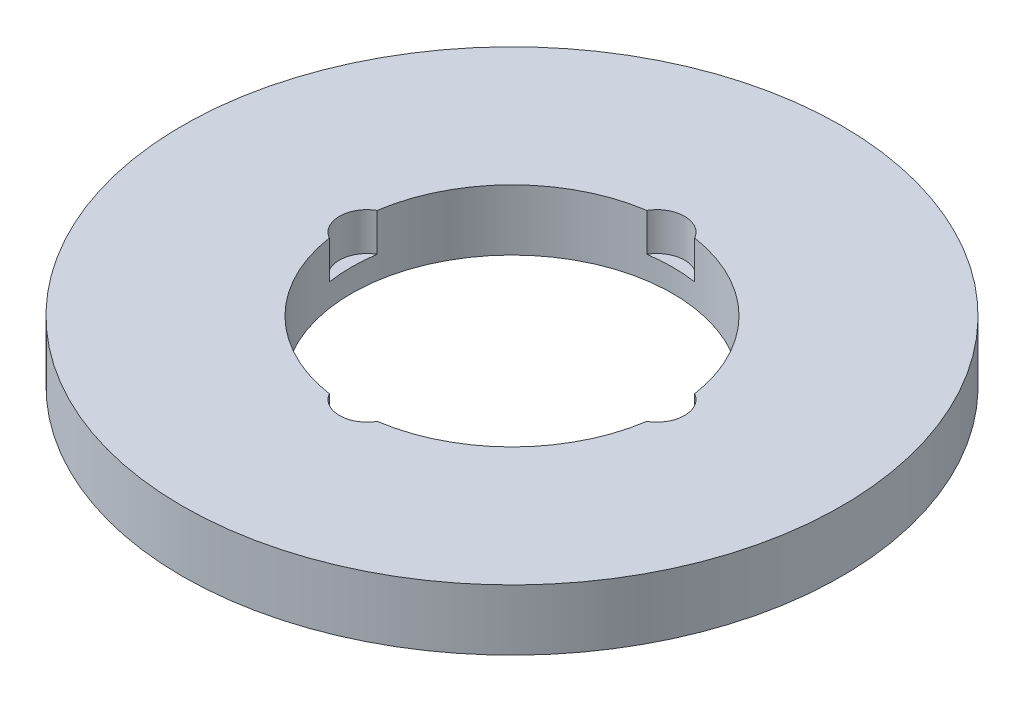
ISO-10303-21;
HEADER;
FILE_DESCRIPTION(('STEP AP214'),'2;1');
FILE_NAME('part.step','',(''),(''),'','','');
FILE_SCHEMA(('AUTOMOTIVE_DESIGN { 1 0 10303 214 1 1 1 1 }'));
ENDSEC;
DATA;
#1=APPLICATION_CONTEXT('core data for automotive mechanical design processes');
#2=APPLICATION_PROTOCOL_DEFINITION('international standard','automotive_design',2000,#1);
#3=PRODUCT_CONTEXT('',#1,'mechanical');
#4=PRODUCT('Part','Part','',(#3));
#5=PRODUCT_RELATED_PRODUCT_CATEGORY('part','',(#4));
#6=PRODUCT_DEFINITION_FORMATION('','',#4);
#7=PRODUCT_DEFINITION_CONTEXT('part definition',#1,'design');
#8=PRODUCT_DEFINITION('design','',#6,#7);
#9=PRODUCT_DEFINITION_SHAPE('','',#8);
#10=(LENGTH_UNIT() NAMED_UNIT(*) SI_UNIT(.MILLI.,.METRE.));
#11=(NAMED_UNIT(*) PLANE_ANGLE_UNIT() SI_UNIT($,.RADIAN.));
#12=(NAMED_UNIT(*) SI_UNIT($,.STERADIAN.) SOLID_ANGLE_UNIT());
#13=UNCERTAINTY_MEASURE_WITH_UNIT(LENGTH_MEASURE(1.E-05),#10,'distance_accuracy_value','');
#14=(GEOMETRIC_REPRESENTATION_CONTEXT(3) GLOBAL_UNCERTAINTY_ASSIGNED_CONTEXT((#13)) GLOBAL_UNIT_ASSIGNED_CONTEXT((#10,
#11,#12)) REPRESENTATION_CONTEXT('',''));
#15=CARTESIAN_POINT('',(0.,0.,0.));
#16=DIRECTION('',(0.,0.,1.));
#17=DIRECTION('',(1.,0.,0.));
#18=AXIS2_PLACEMENT_3D('',#15,#16,#17);
#19=CARTESIAN_POINT('',(0.,18.,0.));
#20=DIRECTION('',(0.,-1.,0.));
#21=DIRECTION('',(0.,0.,-1.));
#22=AXIS2_PLACEMENT_3D('',#19,#20,#21);
#23=CYLINDRICAL_SURFACE('',#22,97.5);
#24=CARTESIAN_POINT('',(0.,18.,0.));
#25=DIRECTION('',(0.,1.,0.));
#26=DIRECTION('',(0.,0.,1.));
#27=AXIS2_PLACEMENT_3D('',#24,#25,#26);
#28=CIRCLE('',#27,97.5);
#29=CARTESIAN_POINT('',(0.,18.,97.5));
#30=VERTEX_POINT('',#29);
#31=EDGE_CURVE('E148',#30,#30,#28,.T.);
#32=ORIENTED_EDGE('',*,*,#31,.F.);
#33=EDGE_LOOP('',(#32));
#34=FACE_BOUND('',#33,.T.);
#35=CARTESIAN_POINT('',(0.,0.,0.));
#36=DIRECTION('',(0.,1.,0.));
#37=DIRECTION('',(0.,0.,1.));
#38=AXIS2_PLACEMENT_3D('',#35,#36,#37);
#39=CIRCLE('',#38,97.5);
#40=CARTESIAN_POINT('',(0.,0.,97.5));
#41=VERTEX_POINT('',#40);
#42=EDGE_CURVE('E139',#41,#41,#39,.T.);
#43=ORIENTED_EDGE('',*,*,#42,.T.);
#44=EDGE_LOOP('',(#43));
#45=FACE_BOUND('',#44,.T.);
#46=ADVANCED_FACE('F39',(#34,#45),#23,.T.);
#47=CARTESIAN_POINT('',(0.,18.,0.));
#48=DIRECTION('',(0.,1.,0.));
#49=DIRECTION('',(0.,0.,1.));
#50=AXIS2_PLACEMENT_3D('',#47,#48,#49);
#51=PLANE('',#50);
#52=CARTESIAN_POINT('',(1.49697635126803E-13,18.,42.8751067523688));
#53=DIRECTION('',(0.,1.,0.));
#54=DIRECTION('',(1.,0.,0.));
#55=AXIS2_PLACEMENT_3D('',#52,#53,#54);
#56=CIRCLE('',#55,8.17998089720507);
#57=CARTESIAN_POINT('',(-7.08174296896249,18.,46.9691272701713));
#58=VERTEX_POINT('',#57);
#59=CARTESIAN_POINT('',(7.08174296896282,18.,46.9691272701713));
#60=VERTEX_POINT('',#59);
#61=EDGE_CURVE('E175',#58,#60,#56,.T.);
#62=ORIENTED_EDGE('',*,*,#61,.F.);
#63=CARTESIAN_POINT('',(0.,18.,0.));
#64=DIRECTION('',(0.,1.,0.));
#65=DIRECTION('',(0.,0.,1.));
#66=AXIS2_PLACEMENT_3D('',#63,#64,#65);
#67=CIRCLE('',#66,47.5);
#68=CARTESIAN_POINT('',(-46.9691272701713,18.,7.08174296896266));
#69=VERTEX_POINT('',#68);
#70=EDGE_CURVE('E134',#69,#58,#67,.T.);
#71=ORIENTED_EDGE('',*,*,#70,.F.);
#72=CARTESIAN_POINT('',(-42.8751067523688,18.,0.));
#73=DIRECTION('',(0.,1.,0.));
#74=DIRECTION('',(0.,0.,1.));
#75=AXIS2_PLACEMENT_3D('',#72,#73,#74);
#76=CIRCLE('',#75,8.17998089720507);
#77=CARTESIAN_POINT('',(-46.9691272701713,18.,-7.08174296896266));
#78=VERTEX_POINT('',#77);
#79=EDGE_CURVE('E143',#78,#69,#76,.T.);
#80=ORIENTED_EDGE('',*,*,#79,.F.);
#81=CARTESIAN_POINT('',(-7.08174296896315,18.,-46.9691272701712));
#82=VERTEX_POINT('',#81);
#83=EDGE_CURVE('E123',#82,#78,#67,.T.);
#84=ORIENTED_EDGE('',*,*,#83,.F.);
#85=CARTESIAN_POINT('',(-4.49092905380409E-13,18.,-42.8751067523688));
#86=DIRECTION('',(0.,1.,0.));
#87=DIRECTION('',(-1.,0.,0.));
#88=AXIS2_PLACEMENT_3D('',#85,#86,#87);
#89=CIRCLE('',#88,8.17998089720507);
#90=CARTESIAN_POINT('',(7.08174296896217,18.,-46.9691272701714));
#91=VERTEX_POINT('',#90);
#92=EDGE_CURVE('E106',#91,#82,#89,.T.);
#93=ORIENTED_EDGE('',*,*,#92,.F.);
#94=CARTESIAN_POINT('',(46.9691272701713,18.,-7.08174296896266));
#95=VERTEX_POINT('',#94);
#96=EDGE_CURVE('E125',#95,#91,#67,.T.);
#97=ORIENTED_EDGE('',*,*,#96,.F.);
#98=CARTESIAN_POINT('',(42.8751067523688,18.,0.));
#99=DIRECTION('',(0.,1.,0.));
#100=DIRECTION('',(0.,0.,-1.));
#101=AXIS2_PLACEMENT_3D('',#98,#99,#100);
#102=CIRCLE('',#101,8.17998089720507);
#103=CARTESIAN_POINT('',(46.9691272701713,18.,7.08174296896266));
#104=VERTEX_POINT('',#103);
#105=EDGE_CURVE('E286',#104,#95,#102,.T.);
#106=ORIENTED_EDGE('',*,*,#105,.F.);
#107=EDGE_CURVE('E135',#60,#104,#67,.T.);
#108=ORIENTED_EDGE('',*,*,#107,.F.);
#109=EDGE_LOOP('',(#62,#71,#80,#84,#93,#97,#106,#108));
#110=FACE_BOUND('',#109,.T.);
#111=ORIENTED_EDGE('',*,*,#31,.T.);
#112=EDGE_LOOP('',(#111));
#113=FACE_BOUND('',#112,.T.);
#114=ADVANCED_FACE('F118',(#110,#113),#51,.T.);
#115=CARTESIAN_POINT('',(0.,0.,0.));
#116=DIRECTION('',(0.,1.,0.));
#117=DIRECTION('',(0.,0.,1.));
#118=AXIS2_PLACEMENT_3D('',#115,#116,#117);
#119=PLANE('',#118);
#120=CARTESIAN_POINT('',(0.,0.,0.));
#121=DIRECTION('',(0.,1.,0.));
#122=DIRECTION('',(0.,0.,1.));
#123=AXIS2_PLACEMENT_3D('',#120,#121,#122);
#124=CIRCLE('',#123,47.5);
#125=CARTESIAN_POINT('',(0.,0.,47.5));
#126=VERTEX_POINT('',#125);
#127=EDGE_CURVE('E136',#126,#126,#124,.T.);
#128=ORIENTED_EDGE('',*,*,#127,.T.);
#129=EDGE_LOOP('',(#128));
#130=FACE_BOUND('',#129,.T.);
#131=ORIENTED_EDGE('',*,*,#42,.F.);
#132=EDGE_LOOP('',(#131));
#133=FACE_BOUND('',#132,.T.);
#134=ADVANCED_FACE('F187',(#130,#133),#119,.F.);
#135=CARTESIAN_POINT('',(0.,18.,0.));
#136=DIRECTION('',(0.,-1.,0.));
#137=DIRECTION('',(0.,0.,-1.));
#138=AXIS2_PLACEMENT_3D('',#135,#136,#137);
#139=CYLINDRICAL_SURFACE('',#138,47.5);
#140=DIRECTION('',(0.,1.,0.));
#141=VECTOR('',#140,1.);
#142=CARTESIAN_POINT('',(-7.0817429689625,12.3762977760969,46.9691272701713));
#143=LINE('',#142,#141);
#144=CARTESIAN_POINT('',(-7.08174296896249,6.75259555219374,46.9691272701713));
#145=VERTEX_POINT('',#144);
#146=EDGE_CURVE('E11',#145,#58,#143,.T.);
#147=ORIENTED_EDGE('',*,*,#146,.F.);
#148=CARTESIAN_POINT('',(0.,6.75259555219374,0.));
#149=DIRECTION('',(0.,1.,0.));
#150=DIRECTION('',(0.,0.,1.));
#151=AXIS2_PLACEMENT_3D('',#148,#149,#150);
#152=CIRCLE('',#151,47.5);
#153=CARTESIAN_POINT('',(7.08174296896282,6.75259555219374,46.9691272701713));
#154=VERTEX_POINT('',#153);
#155=EDGE_CURVE('E170',#145,#154,#152,.T.);
#156=ORIENTED_EDGE('',*,*,#155,.T.);
#157=DIRECTION('',(0.,1.,0.));
#158=VECTOR('',#157,1.);
#159=CARTESIAN_POINT('',(7.08174296896282,12.3762977760969,46.9691272701713));
#160=LINE('',#159,#158);
#161=EDGE_CURVE('E46',#60,#154,#160,.F.);
#162=ORIENTED_EDGE('',*,*,#161,.F.);
#163=ORIENTED_EDGE('',*,*,#107,.T.);
#164=DIRECTION('',(0.,1.,0.));
#165=VECTOR('',#164,1.);
#166=CARTESIAN_POINT('',(46.9691272701713,12.3762977760969,7.08174296896266));
#167=LINE('',#166,#165);
#168=CARTESIAN_POINT('',(46.9691272701713,6.75259555219374,7.08174296896266));
#169=VERTEX_POINT('',#168);
#170=EDGE_CURVE('E164',#169,#104,#167,.T.);
#171=ORIENTED_EDGE('',*,*,#170,.F.);
#172=CARTESIAN_POINT('',(0.,6.75259555219374,0.));
#173=DIRECTION('',(0.,1.,0.));
#174=DIRECTION('',(0.,0.,1.));
#175=AXIS2_PLACEMENT_3D('',#172,#173,#174);
#176=CIRCLE('',#175,47.5);
#177=CARTESIAN_POINT('',(46.9691272701713,6.75259555219374,-7.08174296896266));
#178=VERTEX_POINT('',#177);
#179=EDGE_CURVE('E115',#169,#178,#176,.T.);
#180=ORIENTED_EDGE('',*,*,#179,.T.);
#181=DIRECTION('',(0.,1.,0.));
#182=VECTOR('',#181,1.);
#183=CARTESIAN_POINT('',(46.9691272701713,12.3762977760969,-7.08174296896266));
#184=LINE('',#183,#182);
#185=EDGE_CURVE('E131',#95,#178,#184,.F.);
#186=ORIENTED_EDGE('',*,*,#185,.F.);
#187=ORIENTED_EDGE('',*,*,#96,.T.);
#188=DIRECTION('',(0.,1.,0.));
#189=VECTOR('',#188,1.);
#190=CARTESIAN_POINT('',(7.08174296896216,12.3762977760969,-46.9691272701714));
#191=LINE('',#190,#189);
#192=CARTESIAN_POINT('',(7.08174296896217,6.75259555219374,-46.9691272701714));
#193=VERTEX_POINT('',#192);
#194=EDGE_CURVE('E105',#193,#91,#191,.T.);
#195=ORIENTED_EDGE('',*,*,#194,.F.);
#196=CARTESIAN_POINT('',(0.,6.75259555219374,0.));
#197=DIRECTION('',(0.,1.,0.));
#198=DIRECTION('',(0.,0.,1.));
#199=AXIS2_PLACEMENT_3D('',#196,#197,#198);
#200=CIRCLE('',#199,47.5);
#201=CARTESIAN_POINT('',(-7.08174296896315,6.75259555219374,-46.9691272701712));
#202=VERTEX_POINT('',#201);
#203=EDGE_CURVE('E159',#193,#202,#200,.T.);
#204=ORIENTED_EDGE('',*,*,#203,.T.);
#205=DIRECTION('',(0.,1.,0.));
#206=VECTOR('',#205,1.);
#207=CARTESIAN_POINT('',(-7.08174296896315,12.3762977760969,-46.9691272701712));
#208=LINE('',#207,#206);
#209=EDGE_CURVE('E114',#82,#202,#208,.F.);
#210=ORIENTED_EDGE('',*,*,#209,.F.);
#211=ORIENTED_EDGE('',*,*,#83,.T.);
#212=DIRECTION('',(0.,1.,0.));
#213=VECTOR('',#212,1.);
#214=CARTESIAN_POINT('',(-46.9691272701713,12.3762977760969,-7.08174296896266));
#215=LINE('',#214,#213);
#216=CARTESIAN_POINT('',(-46.9691272701713,6.75259555219374,-7.08174296896266));
#217=VERTEX_POINT('',#216);
#218=EDGE_CURVE('E160',#217,#78,#215,.T.);
#219=ORIENTED_EDGE('',*,*,#218,.F.);
#220=CARTESIAN_POINT('',(0.,6.75259555219374,0.));
#221=DIRECTION('',(0.,1.,0.));
#222=DIRECTION('',(0.,0.,1.));
#223=AXIS2_PLACEMENT_3D('',#220,#221,#222);
#224=CIRCLE('',#223,47.5);
#225=CARTESIAN_POINT('',(-46.9691272701713,6.75259555219374,7.08174296896266));
#226=VERTEX_POINT('',#225);
#227=EDGE_CURVE('E149',#217,#226,#224,.T.);
#228=ORIENTED_EDGE('',*,*,#227,.T.);
#229=DIRECTION('',(0.,1.,0.));
#230=VECTOR('',#229,1.);
#231=CARTESIAN_POINT('',(-46.9691272701713,12.3762977760969,7.08174296896266));
#232=LINE('',#231,#230);
#233=EDGE_CURVE('E152',#69,#226,#232,.F.);
#234=ORIENTED_EDGE('',*,*,#233,.F.);
#235=ORIENTED_EDGE('',*,*,#70,.T.);
#236=EDGE_LOOP('',(#147,#156,#162,#163,#171,#180,#186,#187,#195,#204,#210,#211,#219,#228,#234,#235));
#237=FACE_BOUND('',#236,.T.);
#238=ORIENTED_EDGE('',*,*,#127,.F.);
#239=EDGE_LOOP('',(#238));
#240=FACE_BOUND('',#239,.T.);
#241=ADVANCED_FACE('F126',(#237,#240),#139,.F.);
#242=CARTESIAN_POINT('',(-42.8751067523688,6.75259555219374,0.));
#243=DIRECTION('',(0.,1.,0.));
#244=DIRECTION('',(0.,0.,1.));
#245=AXIS2_PLACEMENT_3D('',#242,#243,#244);
#246=CYLINDRICAL_SURFACE('',#245,8.17998089720507);
#247=ORIENTED_EDGE('',*,*,#218,.T.);
#248=ORIENTED_EDGE('',*,*,#79,.T.);
#249=ORIENTED_EDGE('',*,*,#233,.T.);
#250=CARTESIAN_POINT('',(-42.8751067523688,6.75259555219374,0.));
#251=DIRECTION('',(0.,1.,0.));
#252=DIRECTION('',(0.,0.,1.));
#253=AXIS2_PLACEMENT_3D('',#250,#251,#252);
#254=CIRCLE('',#253,8.17998089720507);
#255=EDGE_CURVE('E144',#217,#226,#254,.T.);
#256=ORIENTED_EDGE('',*,*,#255,.F.);
#257=EDGE_LOOP('',(#247,#248,#249,#256));
#258=FACE_BOUND('',#257,.T.);
#259=ADVANCED_FACE('F200',(#258),#246,.F.);
#260=CARTESIAN_POINT('',(-42.8751067523688,6.75259555219374,0.));
#261=DIRECTION('',(0.,1.,0.));
#262=DIRECTION('',(0.,0.,1.));
#263=AXIS2_PLACEMENT_3D('',#260,#261,#262);
#264=PLANE('',#263);
#265=ORIENTED_EDGE('',*,*,#255,.T.);
#266=ORIENTED_EDGE('',*,*,#227,.F.);
#267=EDGE_LOOP('',(#265,#266));
#268=FACE_BOUND('',#267,.T.);
#269=ADVANCED_FACE('F201',(#268),#264,.T.);
#270=CARTESIAN_POINT('',(-4.49092905380409E-13,6.75259555219374,-42.8751067523688));
#271=DIRECTION('',(0.,1.,0.));
#272=DIRECTION('',(0.,0.,1.));
#273=AXIS2_PLACEMENT_3D('',#270,#271,#272);
#274=CYLINDRICAL_SURFACE('',#273,8.17998089720507);
#275=ORIENTED_EDGE('',*,*,#194,.T.);
#276=ORIENTED_EDGE('',*,*,#92,.T.);
#277=ORIENTED_EDGE('',*,*,#209,.T.);
#278=CARTESIAN_POINT('',(-4.49092905380409E-13,6.75259555219374,-42.8751067523688));
#279=DIRECTION('',(0.,1.,0.));
#280=DIRECTION('',(-1.,0.,0.));
#281=AXIS2_PLACEMENT_3D('',#278,#279,#280);
#282=CIRCLE('',#281,8.17998089720507);
#283=EDGE_CURVE('E107',#193,#202,#282,.T.);
#284=ORIENTED_EDGE('',*,*,#283,.F.);
#285=EDGE_LOOP('',(#275,#276,#277,#284));
#286=FACE_BOUND('',#285,.T.);
#287=ADVANCED_FACE('F102',(#286),#274,.F.);
#288=CARTESIAN_POINT('',(-4.49092905380409E-13,6.75259555219374,-42.8751067523688));
#289=DIRECTION('',(0.,1.,0.));
#290=DIRECTION('',(-1.,0.,0.));
#291=AXIS2_PLACEMENT_3D('',#288,#289,#290);
#292=PLANE('',#291);
#293=ORIENTED_EDGE('',*,*,#283,.T.);
#294=ORIENTED_EDGE('',*,*,#203,.F.);
#295=EDGE_LOOP('',(#293,#294));
#296=FACE_BOUND('',#295,.T.);
#297=ADVANCED_FACE('F209',(#296),#292,.T.);
#298=CARTESIAN_POINT('',(42.8751067523688,6.75259555219374,0.));
#299=DIRECTION('',(0.,1.,0.));
#300=DIRECTION('',(0.,0.,1.));
#301=AXIS2_PLACEMENT_3D('',#298,#299,#300);
#302=CYLINDRICAL_SURFACE('',#301,8.17998089720507);
#303=ORIENTED_EDGE('',*,*,#170,.T.);
#304=ORIENTED_EDGE('',*,*,#105,.T.);
#305=ORIENTED_EDGE('',*,*,#185,.T.);
#306=CARTESIAN_POINT('',(42.8751067523688,6.75259555219374,0.));
#307=DIRECTION('',(0.,1.,0.));
#308=DIRECTION('',(0.,0.,-1.));
#309=AXIS2_PLACEMENT_3D('',#306,#307,#308);
#310=CIRCLE('',#309,8.17998089720507);
#311=EDGE_CURVE('E56',#169,#178,#310,.T.);
#312=ORIENTED_EDGE('',*,*,#311,.F.);
#313=EDGE_LOOP('',(#303,#304,#305,#312));
#314=FACE_BOUND('',#313,.T.);
#315=ADVANCED_FACE('F213',(#314),#302,.F.);
#316=CARTESIAN_POINT('',(42.8751067523688,6.75259555219374,0.));
#317=DIRECTION('',(0.,1.,0.));
#318=DIRECTION('',(0.,0.,-1.));
#319=AXIS2_PLACEMENT_3D('',#316,#317,#318);
#320=PLANE('',#319);
#321=ORIENTED_EDGE('',*,*,#311,.T.);
#322=ORIENTED_EDGE('',*,*,#179,.F.);
#323=EDGE_LOOP('',(#321,#322));
#324=FACE_BOUND('',#323,.T.);
#325=ADVANCED_FACE('F179',(#324),#320,.T.);
#326=CARTESIAN_POINT('',(1.49697635126803E-13,6.75259555219374,42.8751067523688));
#327=DIRECTION('',(0.,1.,0.));
#328=DIRECTION('',(0.,0.,1.));
#329=AXIS2_PLACEMENT_3D('',#326,#327,#328);
#330=CYLINDRICAL_SURFACE('',#329,8.17998089720507);
#331=ORIENTED_EDGE('',*,*,#146,.T.);
#332=ORIENTED_EDGE('',*,*,#61,.T.);
#333=ORIENTED_EDGE('',*,*,#161,.T.);
#334=CARTESIAN_POINT('',(1.49697635126803E-13,6.75259555219374,42.8751067523688));
#335=DIRECTION('',(0.,1.,0.));
#336=DIRECTION('',(1.,0.,0.));
#337=AXIS2_PLACEMENT_3D('',#334,#335,#336);
#338=CIRCLE('',#337,8.17998089720507);
#339=EDGE_CURVE('E55',#145,#154,#338,.T.);
#340=ORIENTED_EDGE('',*,*,#339,.F.);
#341=EDGE_LOOP('',(#331,#332,#333,#340));
#342=FACE_BOUND('',#341,.T.);
#343=ADVANCED_FACE('F171',(#342),#330,.F.);
#344=CARTESIAN_POINT('',(1.49697635126803E-13,6.75259555219374,42.8751067523688));
#345=DIRECTION('',(0.,1.,0.));
#346=DIRECTION('',(1.,0.,0.));
#347=AXIS2_PLACEMENT_3D('',#344,#345,#346);
#348=PLANE('',#347);
#349=ORIENTED_EDGE('',*,*,#339,.T.);
#350=ORIENTED_EDGE('',*,*,#155,.F.);
#351=EDGE_LOOP('',(#349,#350));
#352=FACE_BOUND('',#351,.T.);
#353=ADVANCED_FACE('F173',(#352),#348,.T.);
#354=CLOSED_SHELL('',(#46,#114,#134,#241,#259,#269,#287,#297,#315,#325,#343,#353));
#355=MANIFOLD_SOLID_BREP('B2',#354);
#356=ADVANCED_BREP_SHAPE_REPRESENTATION('',(#18,#355),#14);
#357=SHAPE_DEFINITION_REPRESENTATION(#9,#356);
ENDSEC;
END-ISO-10303-21;
